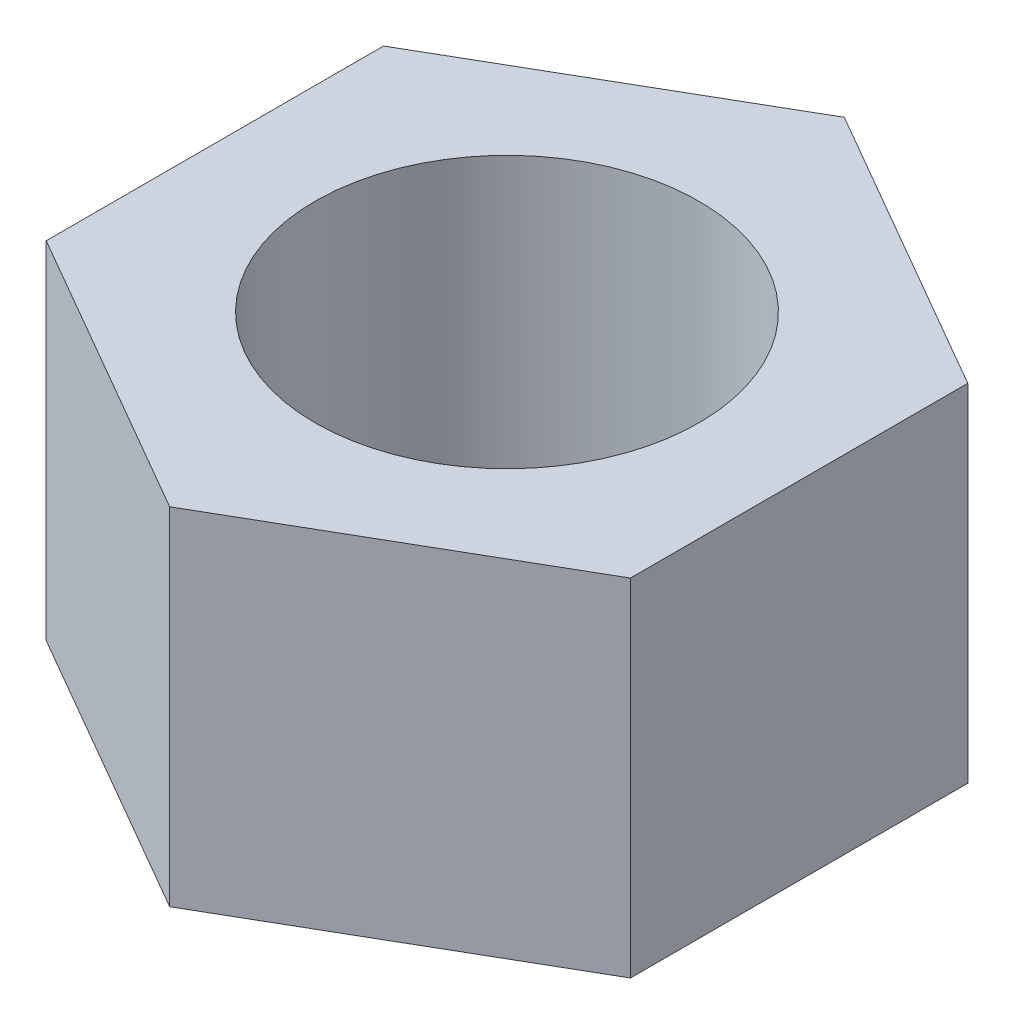
ISO-10303-21;
HEADER;
FILE_DESCRIPTION(('STEP AP214'),'2;1');
FILE_NAME('part.step','',(''),(''),'','','');
FILE_SCHEMA(('AUTOMOTIVE_DESIGN { 1 0 10303 214 1 1 1 1 }'));
ENDSEC;
DATA;
#1=APPLICATION_CONTEXT('core data for automotive mechanical design processes');
#2=APPLICATION_PROTOCOL_DEFINITION('international standard','automotive_design',2000,#1);
#3=PRODUCT_CONTEXT('',#1,'mechanical');
#4=PRODUCT('Part','Part','',(#3));
#5=PRODUCT_RELATED_PRODUCT_CATEGORY('part','',(#4));
#6=PRODUCT_DEFINITION_FORMATION('','',#4);
#7=PRODUCT_DEFINITION_CONTEXT('part definition',#1,'design');
#8=PRODUCT_DEFINITION('design','',#6,#7);
#9=PRODUCT_DEFINITION_SHAPE('','',#8);
#10=(LENGTH_UNIT() NAMED_UNIT(*) SI_UNIT(.MILLI.,.METRE.));
#11=(NAMED_UNIT(*) PLANE_ANGLE_UNIT() SI_UNIT($,.RADIAN.));
#12=(NAMED_UNIT(*) SI_UNIT($,.STERADIAN.) SOLID_ANGLE_UNIT());
#13=UNCERTAINTY_MEASURE_WITH_UNIT(LENGTH_MEASURE(1.E-05),#10,'distance_accuracy_value','');
#14=(GEOMETRIC_REPRESENTATION_CONTEXT(3) GLOBAL_UNCERTAINTY_ASSIGNED_CONTEXT((#13)) GLOBAL_UNIT_ASSIGNED_CONTEXT((#10,
#11,#12)) REPRESENTATION_CONTEXT('',''));
#15=CARTESIAN_POINT('',(0.,0.,0.));
#16=DIRECTION('',(0.,0.,1.));
#17=DIRECTION('',(1.,0.,0.));
#18=AXIS2_PLACEMENT_3D('',#15,#16,#17);
#19=CARTESIAN_POINT('',(7.,8.3,-4.04145188432739));
#20=DIRECTION('',(-0.5,0.,0.866025403784439));
#21=DIRECTION('',(0.866025403784439,0.,0.5));
#22=AXIS2_PLACEMENT_3D('',#19,#20,#21);
#23=PLANE('',#22);
#24=DIRECTION('',(-0.866025403784439,0.,-0.5));
#25=VECTOR('',#24,1.);
#26=CARTESIAN_POINT('',(7.,0.,-4.04145188432739));
#27=LINE('',#26,#25);
#28=CARTESIAN_POINT('',(7.,0.,-4.04145188432739));
#29=VERTEX_POINT('',#28);
#30=CARTESIAN_POINT('',(0.,0.,-8.08290376865477));
#31=VERTEX_POINT('',#30);
#32=EDGE_CURVE('E128',#29,#31,#27,.T.);
#33=ORIENTED_EDGE('',*,*,#32,.T.);
#34=DIRECTION('',(0.,-1.,0.));
#35=VECTOR('',#34,1.);
#36=CARTESIAN_POINT('',(0.,8.3,-8.08290376865477));
#37=LINE('',#36,#35);
#38=CARTESIAN_POINT('',(0.,8.3,-8.08290376865477));
#39=VERTEX_POINT('',#38);
#40=EDGE_CURVE('E11',#39,#31,#37,.T.);
#41=ORIENTED_EDGE('',*,*,#40,.F.);
#42=DIRECTION('',(-0.866025403784439,0.,-0.5));
#43=VECTOR('',#42,1.);
#44=CARTESIAN_POINT('',(7.,8.3,-4.04145188432739));
#45=LINE('',#44,#43);
#46=CARTESIAN_POINT('',(7.,8.3,-4.04145188432739));
#47=VERTEX_POINT('',#46);
#48=EDGE_CURVE('E145',#47,#39,#45,.T.);
#49=ORIENTED_EDGE('',*,*,#48,.F.);
#50=DIRECTION('',(0.,-1.,0.));
#51=VECTOR('',#50,1.);
#52=CARTESIAN_POINT('',(7.,8.3,-4.04145188432739));
#53=LINE('',#52,#51);
#54=EDGE_CURVE('E124',#47,#29,#53,.T.);
#55=ORIENTED_EDGE('',*,*,#54,.T.);
#56=EDGE_LOOP('',(#33,#41,#49,#55));
#57=FACE_BOUND('',#56,.T.);
#58=ADVANCED_FACE('F39',(#57),#23,.F.);
#59=CARTESIAN_POINT('',(0.,8.3,-8.08290376865477));
#60=DIRECTION('',(0.5,0.,0.866025403784439));
#61=DIRECTION('',(0.866025403784439,0.,-0.5));
#62=AXIS2_PLACEMENT_3D('',#59,#60,#61);
#63=PLANE('',#62);
#64=DIRECTION('',(-0.866025403784439,0.,0.5));
#65=VECTOR('',#64,1.);
#66=CARTESIAN_POINT('',(0.,0.,-8.08290376865477));
#67=LINE('',#66,#65);
#68=CARTESIAN_POINT('',(-7.00000000000001,0.,-4.04145188432738));
#69=VERTEX_POINT('',#68);
#70=EDGE_CURVE('E132',#31,#69,#67,.T.);
#71=ORIENTED_EDGE('',*,*,#70,.T.);
#72=DIRECTION('',(0.,-1.,0.));
#73=VECTOR('',#72,1.);
#74=CARTESIAN_POINT('',(-7.00000000000001,8.3,-4.04145188432738));
#75=LINE('',#74,#73);
#76=CARTESIAN_POINT('',(-7.00000000000001,8.3,-4.04145188432738));
#77=VERTEX_POINT('',#76);
#78=EDGE_CURVE('E48',#77,#69,#75,.T.);
#79=ORIENTED_EDGE('',*,*,#78,.F.);
#80=DIRECTION('',(-0.866025403784439,0.,0.5));
#81=VECTOR('',#80,1.);
#82=CARTESIAN_POINT('',(0.,8.3,-8.08290376865477));
#83=LINE('',#82,#81);
#84=EDGE_CURVE('E93',#39,#77,#83,.T.);
#85=ORIENTED_EDGE('',*,*,#84,.F.);
#86=ORIENTED_EDGE('',*,*,#40,.T.);
#87=EDGE_LOOP('',(#71,#79,#85,#86));
#88=FACE_BOUND('',#87,.T.);
#89=ADVANCED_FACE('F174',(#88),#63,.F.);
#90=CARTESIAN_POINT('',(-7.00000000000001,8.3,-4.04145188432738));
#91=DIRECTION('',(1.,0.,0.));
#92=DIRECTION('',(0.,0.,-1.));
#93=AXIS2_PLACEMENT_3D('',#90,#91,#92);
#94=PLANE('',#93);
#95=DIRECTION('',(0.,0.,1.));
#96=VECTOR('',#95,1.);
#97=CARTESIAN_POINT('',(-7.00000000000001,0.,-4.04145188432738));
#98=LINE('',#97,#96);
#99=CARTESIAN_POINT('',(-7.00000000000001,0.,4.04145188432738));
#100=VERTEX_POINT('',#99);
#101=EDGE_CURVE('E136',#69,#100,#98,.T.);
#102=ORIENTED_EDGE('',*,*,#101,.T.);
#103=DIRECTION('',(0.,-1.,0.));
#104=VECTOR('',#103,1.);
#105=CARTESIAN_POINT('',(-7.00000000000001,8.3,4.04145188432738));
#106=LINE('',#105,#104);
#107=CARTESIAN_POINT('',(-7.00000000000001,8.3,4.04145188432738));
#108=VERTEX_POINT('',#107);
#109=EDGE_CURVE('E117',#108,#100,#106,.T.);
#110=ORIENTED_EDGE('',*,*,#109,.F.);
#111=DIRECTION('',(0.,0.,1.));
#112=VECTOR('',#111,1.);
#113=CARTESIAN_POINT('',(-7.00000000000001,8.3,-4.04145188432738));
#114=LINE('',#113,#112);
#115=EDGE_CURVE('E106',#77,#108,#114,.T.);
#116=ORIENTED_EDGE('',*,*,#115,.F.);
#117=ORIENTED_EDGE('',*,*,#78,.T.);
#118=EDGE_LOOP('',(#102,#110,#116,#117));
#119=FACE_BOUND('',#118,.T.);
#120=ADVANCED_FACE('F155',(#119),#94,.F.);
#121=CARTESIAN_POINT('',(-7.00000000000001,8.3,4.04145188432738));
#122=DIRECTION('',(0.500000000000001,0.,-0.866025403784438));
#123=DIRECTION('',(-0.866025403784438,0.,-0.500000000000001));
#124=AXIS2_PLACEMENT_3D('',#121,#122,#123);
#125=PLANE('',#124);
#126=DIRECTION('',(0.866025403784438,0.,0.500000000000001));
#127=VECTOR('',#126,1.);
#128=CARTESIAN_POINT('',(-7.00000000000001,0.,4.04145188432738));
#129=LINE('',#128,#127);
#130=CARTESIAN_POINT('',(0.,0.,8.08290376865477));
#131=VERTEX_POINT('',#130);
#132=EDGE_CURVE('E115',#100,#131,#129,.T.);
#133=ORIENTED_EDGE('',*,*,#132,.T.);
#134=DIRECTION('',(0.,-1.,0.));
#135=VECTOR('',#134,1.);
#136=CARTESIAN_POINT('',(0.,8.3,8.08290376865477));
#137=LINE('',#136,#135);
#138=CARTESIAN_POINT('',(0.,8.3,8.08290376865477));
#139=VERTEX_POINT('',#138);
#140=EDGE_CURVE('E112',#139,#131,#137,.T.);
#141=ORIENTED_EDGE('',*,*,#140,.F.);
#142=DIRECTION('',(0.866025403784438,0.,0.500000000000001));
#143=VECTOR('',#142,1.);
#144=CARTESIAN_POINT('',(-7.00000000000001,8.3,4.04145188432738));
#145=LINE('',#144,#143);
#146=EDGE_CURVE('E100',#108,#139,#145,.T.);
#147=ORIENTED_EDGE('',*,*,#146,.F.);
#148=ORIENTED_EDGE('',*,*,#109,.T.);
#149=EDGE_LOOP('',(#133,#141,#147,#148));
#150=FACE_BOUND('',#149,.T.);
#151=ADVANCED_FACE('F113',(#150),#125,.F.);
#152=CARTESIAN_POINT('',(0.,8.3,8.08290376865477));
#153=DIRECTION('',(-0.5,0.,-0.866025403784438));
#154=DIRECTION('',(-0.866025403784439,0.,0.5));
#155=AXIS2_PLACEMENT_3D('',#152,#153,#154);
#156=PLANE('',#155);
#157=DIRECTION('',(0.866025403784438,0.,-0.5));
#158=VECTOR('',#157,1.);
#159=CARTESIAN_POINT('',(0.,0.,8.08290376865477));
#160=LINE('',#159,#158);
#161=CARTESIAN_POINT('',(7.,0.,4.04145188432738));
#162=VERTEX_POINT('',#161);
#163=EDGE_CURVE('E79',#131,#162,#160,.T.);
#164=ORIENTED_EDGE('',*,*,#163,.T.);
#165=DIRECTION('',(0.,-1.,0.));
#166=VECTOR('',#165,1.);
#167=CARTESIAN_POINT('',(7.,8.3,4.04145188432738));
#168=LINE('',#167,#166);
#169=CARTESIAN_POINT('',(7.,8.3,4.04145188432738));
#170=VERTEX_POINT('',#169);
#171=EDGE_CURVE('E118',#170,#162,#168,.T.);
#172=ORIENTED_EDGE('',*,*,#171,.F.);
#173=DIRECTION('',(0.866025403784438,0.,-0.5));
#174=VECTOR('',#173,1.);
#175=CARTESIAN_POINT('',(0.,8.3,8.08290376865477));
#176=LINE('',#175,#174);
#177=EDGE_CURVE('E104',#139,#170,#176,.T.);
#178=ORIENTED_EDGE('',*,*,#177,.F.);
#179=ORIENTED_EDGE('',*,*,#140,.T.);
#180=EDGE_LOOP('',(#164,#172,#178,#179));
#181=FACE_BOUND('',#180,.T.);
#182=ADVANCED_FACE('F120',(#181),#156,.F.);
#183=CARTESIAN_POINT('',(7.,8.3,4.04145188432738));
#184=DIRECTION('',(-1.,0.,0.));
#185=DIRECTION('',(0.,0.,1.));
#186=AXIS2_PLACEMENT_3D('',#183,#184,#185);
#187=PLANE('',#186);
#188=DIRECTION('',(0.,0.,-1.));
#189=VECTOR('',#188,1.);
#190=CARTESIAN_POINT('',(7.,0.,4.04145188432738));
#191=LINE('',#190,#189);
#192=EDGE_CURVE('E85',#162,#29,#191,.T.);
#193=ORIENTED_EDGE('',*,*,#192,.T.);
#194=ORIENTED_EDGE('',*,*,#54,.F.);
#195=DIRECTION('',(0.,0.,-1.));
#196=VECTOR('',#195,1.);
#197=CARTESIAN_POINT('',(7.,8.3,4.04145188432738));
#198=LINE('',#197,#196);
#199=EDGE_CURVE('E56',#170,#47,#198,.T.);
#200=ORIENTED_EDGE('',*,*,#199,.F.);
#201=ORIENTED_EDGE('',*,*,#171,.T.);
#202=EDGE_LOOP('',(#193,#194,#200,#201));
#203=FACE_BOUND('',#202,.T.);
#204=ADVANCED_FACE('F162',(#203),#187,.F.);
#205=CARTESIAN_POINT('',(0.,8.3,0.));
#206=DIRECTION('',(0.,1.,0.));
#207=DIRECTION('',(0.,0.,1.));
#208=AXIS2_PLACEMENT_3D('',#205,#206,#207);
#209=PLANE('',#208);
#210=CARTESIAN_POINT('',(0.,8.3,0.));
#211=DIRECTION('',(0.,1.,0.));
#212=DIRECTION('',(0.,0.,1.));
#213=AXIS2_PLACEMENT_3D('',#210,#211,#212);
#214=CIRCLE('',#213,4.6);
#215=CARTESIAN_POINT('',(0.,8.3,4.6));
#216=VERTEX_POINT('',#215);
#217=EDGE_CURVE('E229',#216,#216,#214,.T.);
#218=ORIENTED_EDGE('',*,*,#217,.F.);
#219=EDGE_LOOP('',(#218));
#220=FACE_BOUND('',#219,.T.);
#221=ORIENTED_EDGE('',*,*,#48,.T.);
#222=ORIENTED_EDGE('',*,*,#84,.T.);
#223=ORIENTED_EDGE('',*,*,#115,.T.);
#224=ORIENTED_EDGE('',*,*,#146,.T.);
#225=ORIENTED_EDGE('',*,*,#177,.T.);
#226=ORIENTED_EDGE('',*,*,#199,.T.);
#227=EDGE_LOOP('',(#221,#222,#223,#224,#225,#226));
#228=FACE_BOUND('',#227,.T.);
#229=ADVANCED_FACE('F102',(#220,#228),#209,.T.);
#230=CARTESIAN_POINT('',(0.,0.,0.));
#231=DIRECTION('',(0.,1.,0.));
#232=DIRECTION('',(0.,0.,1.));
#233=AXIS2_PLACEMENT_3D('',#230,#231,#232);
#234=PLANE('',#233);
#235=CARTESIAN_POINT('',(0.,0.,0.));
#236=DIRECTION('',(0.,1.,0.));
#237=DIRECTION('',(0.,0.,1.));
#238=AXIS2_PLACEMENT_3D('',#235,#236,#237);
#239=CIRCLE('',#238,4.6);
#240=CARTESIAN_POINT('',(0.,0.,4.6));
#241=VERTEX_POINT('',#240);
#242=EDGE_CURVE('E133',#241,#241,#239,.T.);
#243=ORIENTED_EDGE('',*,*,#242,.T.);
#244=EDGE_LOOP('',(#243));
#245=FACE_BOUND('',#244,.T.);
#246=ORIENTED_EDGE('',*,*,#32,.F.);
#247=ORIENTED_EDGE('',*,*,#192,.F.);
#248=ORIENTED_EDGE('',*,*,#163,.F.);
#249=ORIENTED_EDGE('',*,*,#132,.F.);
#250=ORIENTED_EDGE('',*,*,#101,.F.);
#251=ORIENTED_EDGE('',*,*,#70,.F.);
#252=EDGE_LOOP('',(#246,#247,#248,#249,#250,#251));
#253=FACE_BOUND('',#252,.T.);
#254=ADVANCED_FACE('F158',(#245,#253),#234,.F.);
#255=CARTESIAN_POINT('',(0.,0.,0.));
#256=DIRECTION('',(0.,1.,0.));
#257=DIRECTION('',(0.,0.,1.));
#258=AXIS2_PLACEMENT_3D('',#255,#256,#257);
#259=CYLINDRICAL_SURFACE('',#258,4.6);
#260=ORIENTED_EDGE('',*,*,#242,.F.);
#261=EDGE_LOOP('',(#260));
#262=FACE_BOUND('',#261,.T.);
#263=ORIENTED_EDGE('',*,*,#217,.T.);
#264=EDGE_LOOP('',(#263));
#265=FACE_BOUND('',#264,.T.);
#266=ADVANCED_FACE('F211',(#262,#265),#259,.F.);
#267=CLOSED_SHELL('',(#58,#89,#120,#151,#182,#204,#229,#254,#266));
#268=MANIFOLD_SOLID_BREP('B2',#267);
#269=ADVANCED_BREP_SHAPE_REPRESENTATION('',(#18,#268),#14);
#270=SHAPE_DEFINITION_REPRESENTATION(#9,#269);
ENDSEC;
END-ISO-10303-21;
